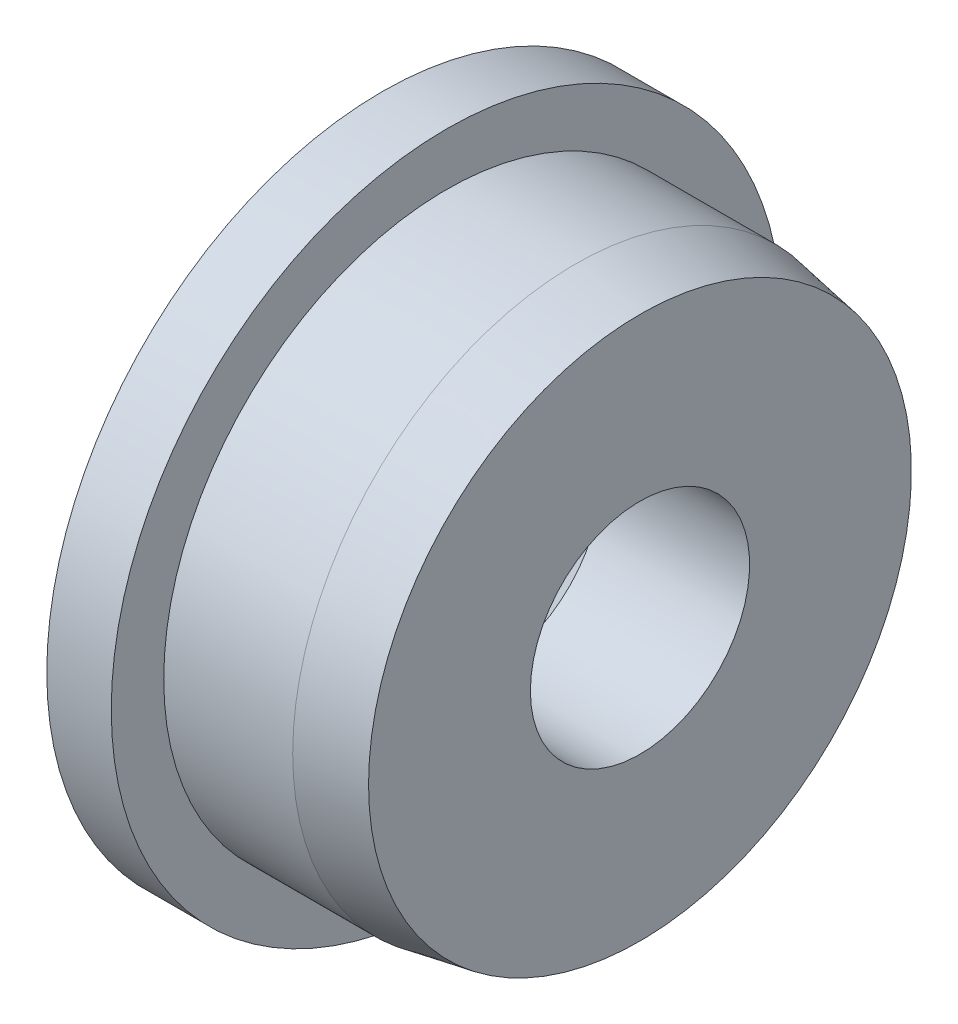
ISO-10303-21;
HEADER;
FILE_DESCRIPTION(('STEP AP214'),'2;1');
FILE_NAME('part.step','',(''),(''),'','','');
FILE_SCHEMA(('AUTOMOTIVE_DESIGN { 1 0 10303 214 1 1 1 1 }'));
ENDSEC;
DATA;
#1=APPLICATION_CONTEXT('core data for automotive mechanical design processes');
#2=APPLICATION_PROTOCOL_DEFINITION('international standard','automotive_design',2000,#1);
#3=PRODUCT_CONTEXT('',#1,'mechanical');
#4=PRODUCT('Part','Part','',(#3));
#5=PRODUCT_RELATED_PRODUCT_CATEGORY('part','',(#4));
#6=PRODUCT_DEFINITION_FORMATION('','',#4);
#7=PRODUCT_DEFINITION_CONTEXT('part definition',#1,'design');
#8=PRODUCT_DEFINITION('design','',#6,#7);
#9=PRODUCT_DEFINITION_SHAPE('','',#8);
#10=(LENGTH_UNIT() NAMED_UNIT(*) SI_UNIT(.MILLI.,.METRE.));
#11=(NAMED_UNIT(*) PLANE_ANGLE_UNIT() SI_UNIT($,.RADIAN.));
#12=(NAMED_UNIT(*) SI_UNIT($,.STERADIAN.) SOLID_ANGLE_UNIT());
#13=UNCERTAINTY_MEASURE_WITH_UNIT(LENGTH_MEASURE(1.E-05),#10,'distance_accuracy_value','');
#14=(GEOMETRIC_REPRESENTATION_CONTEXT(3) GLOBAL_UNCERTAINTY_ASSIGNED_CONTEXT((#13)) GLOBAL_UNIT_ASSIGNED_CONTEXT((#10,
#11,#12)) REPRESENTATION_CONTEXT('',''));
#15=CARTESIAN_POINT('',(0.,0.,0.));
#16=DIRECTION('',(0.,0.,1.));
#17=DIRECTION('',(1.,0.,0.));
#18=AXIS2_PLACEMENT_3D('',#15,#16,#17);
#19=CARTESIAN_POINT('',(3.81,5.34628473450025,0.));
#20=DIRECTION('',(-1.,0.,0.));
#21=DIRECTION('',(0.,0.,1.));
#22=AXIS2_PLACEMENT_3D('',#19,#20,#21);
#23=PLANE('',#22);
#24=CARTESIAN_POINT('',(3.81,0.,0.));
#25=DIRECTION('',(-1.,0.,0.));
#26=DIRECTION('',(0.,0.,1.));
#27=AXIS2_PLACEMENT_3D('',#24,#25,#26);
#28=CIRCLE('',#27,5.34628473450025);
#29=CARTESIAN_POINT('',(3.81,0.,5.34628473450025));
#30=VERTEX_POINT('',#29);
#31=EDGE_CURVE('E61',#30,#30,#28,.T.);
#32=ORIENTED_EDGE('',*,*,#31,.F.);
#33=EDGE_LOOP('',(#32));
#34=FACE_BOUND('',#33,.T.);
#35=CARTESIAN_POINT('',(3.81,0.,0.));
#36=DIRECTION('',(-1.,0.,0.));
#37=DIRECTION('',(0.,0.,1.));
#38=AXIS2_PLACEMENT_3D('',#35,#36,#37);
#39=CIRCLE('',#38,2.159);
#40=CARTESIAN_POINT('',(3.81,0.,2.159));
#41=VERTEX_POINT('',#40);
#42=EDGE_CURVE('E10',#41,#41,#39,.T.);
#43=ORIENTED_EDGE('',*,*,#42,.T.);
#44=EDGE_LOOP('',(#43));
#45=FACE_BOUND('',#44,.T.);
#46=ADVANCED_FACE('F33',(#34,#45),#23,.F.);
#47=CARTESIAN_POINT('',(0.,0.,0.));
#48=DIRECTION('',(-1.,0.,0.));
#49=DIRECTION('',(0.,0.,1.));
#50=AXIS2_PLACEMENT_3D('',#47,#48,#49);
#51=CYLINDRICAL_SURFACE('',#50,2.159);
#52=ORIENTED_EDGE('',*,*,#42,.F.);
#53=EDGE_LOOP('',(#52));
#54=FACE_BOUND('',#53,.T.);
#55=CARTESIAN_POINT('',(0.889000000000026,0.,0.));
#56=DIRECTION('',(-1.,0.,0.));
#57=DIRECTION('',(0.,0.,1.));
#58=AXIS2_PLACEMENT_3D('',#55,#56,#57);
#59=CIRCLE('',#58,2.159);
#60=CARTESIAN_POINT('',(0.889000000000026,0.,2.159));
#61=VERTEX_POINT('',#60);
#62=EDGE_CURVE('E39',#61,#61,#59,.T.);
#63=ORIENTED_EDGE('',*,*,#62,.T.);
#64=EDGE_LOOP('',(#63));
#65=FACE_BOUND('',#64,.T.);
#66=ADVANCED_FACE('F68',(#54,#65),#51,.F.);
#67=CARTESIAN_POINT('',(-1.27,0.,0.));
#68=DIRECTION('',(-1.,0.,0.));
#69=DIRECTION('',(0.,0.,1.));
#70=AXIS2_PLACEMENT_3D('',#67,#68,#69);
#71=CONICAL_SURFACE('',#70,4.318,0.785398163397442);
#72=ORIENTED_EDGE('',*,*,#62,.F.);
#73=EDGE_LOOP('',(#72));
#74=FACE_BOUND('',#73,.T.);
#75=CARTESIAN_POINT('',(-1.27,0.,0.));
#76=DIRECTION('',(-1.,0.,0.));
#77=DIRECTION('',(0.,0.,1.));
#78=AXIS2_PLACEMENT_3D('',#75,#76,#77);
#79=CIRCLE('',#78,4.318);
#80=CARTESIAN_POINT('',(-1.27,0.,4.318));
#81=VERTEX_POINT('',#80);
#82=EDGE_CURVE('E43',#81,#81,#79,.T.);
#83=ORIENTED_EDGE('',*,*,#82,.T.);
#84=EDGE_LOOP('',(#83));
#85=FACE_BOUND('',#84,.T.);
#86=ADVANCED_FACE('F72',(#74,#85),#71,.F.);
#87=CARTESIAN_POINT('',(-1.27,4.318,0.));
#88=DIRECTION('',(1.,0.,0.));
#89=DIRECTION('',(0.,0.,-1.));
#90=AXIS2_PLACEMENT_3D('',#87,#88,#89);
#91=PLANE('',#90);
#92=ORIENTED_EDGE('',*,*,#82,.F.);
#93=EDGE_LOOP('',(#92));
#94=FACE_BOUND('',#93,.T.);
#95=CARTESIAN_POINT('',(-1.27,0.,0.));
#96=DIRECTION('',(-1.,0.,0.));
#97=DIRECTION('',(0.,0.,1.));
#98=AXIS2_PLACEMENT_3D('',#95,#96,#97);
#99=CIRCLE('',#98,6.604);
#100=CARTESIAN_POINT('',(-1.27,0.,6.604));
#101=VERTEX_POINT('',#100);
#102=EDGE_CURVE('E47',#101,#101,#99,.T.);
#103=ORIENTED_EDGE('',*,*,#102,.T.);
#104=EDGE_LOOP('',(#103));
#105=FACE_BOUND('',#104,.T.);
#106=ADVANCED_FACE('F77',(#94,#105),#91,.F.);
#107=CARTESIAN_POINT('',(0.,0.,0.));
#108=DIRECTION('',(-1.,0.,0.));
#109=DIRECTION('',(0.,0.,1.));
#110=AXIS2_PLACEMENT_3D('',#107,#108,#109);
#111=CYLINDRICAL_SURFACE('',#110,6.604);
#112=ORIENTED_EDGE('',*,*,#102,.F.);
#113=EDGE_LOOP('',(#112));
#114=FACE_BOUND('',#113,.T.);
#115=CARTESIAN_POINT('',(0.,0.,0.));
#116=DIRECTION('',(-1.,0.,0.));
#117=DIRECTION('',(0.,0.,1.));
#118=AXIS2_PLACEMENT_3D('',#115,#116,#117);
#119=CIRCLE('',#118,6.604);
#120=CARTESIAN_POINT('',(0.,0.,6.604));
#121=VERTEX_POINT('',#120);
#122=EDGE_CURVE('E52',#121,#121,#119,.T.);
#123=ORIENTED_EDGE('',*,*,#122,.T.);
#124=EDGE_LOOP('',(#123));
#125=FACE_BOUND('',#124,.T.);
#126=ADVANCED_FACE('F83',(#114,#125),#111,.T.);
#127=CARTESIAN_POINT('',(0.,6.604,0.));
#128=DIRECTION('',(-1.,0.,0.));
#129=DIRECTION('',(0.,0.,1.));
#130=AXIS2_PLACEMENT_3D('',#127,#128,#129);
#131=PLANE('',#130);
#132=ORIENTED_EDGE('',*,*,#122,.F.);
#133=EDGE_LOOP('',(#132));
#134=FACE_BOUND('',#133,.T.);
#135=CARTESIAN_POINT('',(0.,0.,0.));
#136=DIRECTION('',(-1.,0.,0.));
#137=DIRECTION('',(0.,0.,1.));
#138=AXIS2_PLACEMENT_3D('',#135,#136,#137);
#139=CIRCLE('',#138,5.57022);
#140=CARTESIAN_POINT('',(0.,0.,5.57022));
#141=VERTEX_POINT('',#140);
#142=EDGE_CURVE('E55',#141,#141,#139,.T.);
#143=ORIENTED_EDGE('',*,*,#142,.T.);
#144=EDGE_LOOP('',(#143));
#145=FACE_BOUND('',#144,.T.);
#146=ADVANCED_FACE('F87',(#134,#145),#131,.F.);
#147=CARTESIAN_POINT('',(0.,0.,0.));
#148=DIRECTION('',(-1.,0.,0.));
#149=DIRECTION('',(0.,0.,1.));
#150=AXIS2_PLACEMENT_3D('',#147,#148,#149);
#151=CYLINDRICAL_SURFACE('',#150,5.57022);
#152=ORIENTED_EDGE('',*,*,#142,.F.);
#153=EDGE_LOOP('',(#152));
#154=FACE_BOUND('',#153,.T.);
#155=CARTESIAN_POINT('',(2.54,0.,0.));
#156=DIRECTION('',(-1.,0.,0.));
#157=DIRECTION('',(0.,0.,1.));
#158=AXIS2_PLACEMENT_3D('',#155,#156,#157);
#159=CIRCLE('',#158,5.57022);
#160=CARTESIAN_POINT('',(2.54,0.,5.57022));
#161=VERTEX_POINT('',#160);
#162=EDGE_CURVE('E58',#161,#161,#159,.T.);
#163=ORIENTED_EDGE('',*,*,#162,.T.);
#164=EDGE_LOOP('',(#163));
#165=FACE_BOUND('',#164,.T.);
#166=ADVANCED_FACE('F91',(#154,#165),#151,.T.);
#167=CARTESIAN_POINT('',(3.81,0.,0.));
#168=DIRECTION('',(-1.,0.,0.));
#169=DIRECTION('',(0.,0.,1.));
#170=AXIS2_PLACEMENT_3D('',#167,#168,#169);
#171=CONICAL_SURFACE('',#170,5.34628473450025,0.174532925199434);
#172=ORIENTED_EDGE('',*,*,#162,.F.);
#173=EDGE_LOOP('',(#172));
#174=FACE_BOUND('',#173,.T.);
#175=ORIENTED_EDGE('',*,*,#31,.T.);
#176=EDGE_LOOP('',(#175));
#177=FACE_BOUND('',#176,.T.);
#178=ADVANCED_FACE('F65',(#174,#177),#171,.T.);
#179=CLOSED_SHELL('',(#46,#66,#86,#106,#126,#146,#166,#178));
#180=MANIFOLD_SOLID_BREP('B2',#179);
#181=ADVANCED_BREP_SHAPE_REPRESENTATION('',(#18,#180),#14);
#182=SHAPE_DEFINITION_REPRESENTATION(#9,#181);
ENDSEC;
END-ISO-10303-21;
